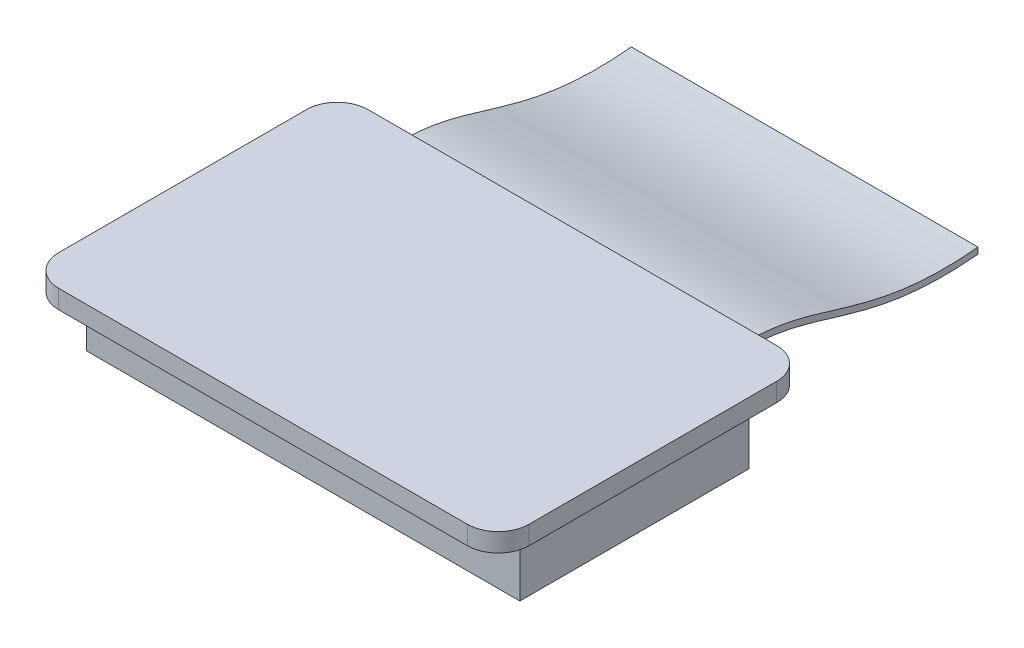
ISO-10303-21;
HEADER;
FILE_DESCRIPTION(('STEP AP214'),'2;1');
FILE_NAME('part.step','',(''),(''),'','','');
FILE_SCHEMA(('AUTOMOTIVE_DESIGN { 1 0 10303 214 1 1 1 1 }'));
ENDSEC;
DATA;
#1=APPLICATION_CONTEXT('core data for automotive mechanical design processes');
#2=APPLICATION_PROTOCOL_DEFINITION('international standard','automotive_design',2000,#1);
#3=PRODUCT_CONTEXT('',#1,'mechanical');
#4=PRODUCT('Part','Part','',(#3));
#5=PRODUCT_RELATED_PRODUCT_CATEGORY('part','',(#4));
#6=PRODUCT_DEFINITION_FORMATION('','',#4);
#7=PRODUCT_DEFINITION_CONTEXT('part definition',#1,'design');
#8=PRODUCT_DEFINITION('design','',#6,#7);
#9=PRODUCT_DEFINITION_SHAPE('','',#8);
#10=(LENGTH_UNIT() NAMED_UNIT(*) SI_UNIT(.MILLI.,.METRE.));
#11=(NAMED_UNIT(*) PLANE_ANGLE_UNIT() SI_UNIT($,.RADIAN.));
#12=(NAMED_UNIT(*) SI_UNIT($,.STERADIAN.) SOLID_ANGLE_UNIT());
#13=UNCERTAINTY_MEASURE_WITH_UNIT(LENGTH_MEASURE(1.E-05),#10,'distance_accuracy_value','');
#14=(GEOMETRIC_REPRESENTATION_CONTEXT(3) GLOBAL_UNCERTAINTY_ASSIGNED_CONTEXT((#13)) GLOBAL_UNIT_ASSIGNED_CONTEXT((#10,
#11,#12)) REPRESENTATION_CONTEXT('',''));
#15=CARTESIAN_POINT('',(0.,0.,0.));
#16=DIRECTION('',(0.,0.,1.));
#17=DIRECTION('',(1.,0.,0.));
#18=AXIS2_PLACEMENT_3D('',#15,#16,#17);
#19=CARTESIAN_POINT('',(3.3,0.748301222298696,8.25169585037883));
#20=DIRECTION('',(0.,-1.,0.));
#21=DIRECTION('',(0.,0.,-1.));
#22=AXIS2_PLACEMENT_3D('',#19,#20,#21);
#23=CYLINDRICAL_SURFACE('',#22,0.5);
#24=CARTESIAN_POINT('',(3.3,0.448301222298696,8.25169585037883));
#25=DIRECTION('',(0.,-1.,0.));
#26=DIRECTION('',(0.,0.,-1.));
#27=AXIS2_PLACEMENT_3D('',#24,#25,#26);
#28=CIRCLE('',#27,0.5);
#29=CARTESIAN_POINT('',(3.3,0.448301222298696,7.75169585037883));
#30=VERTEX_POINT('',#29);
#31=CARTESIAN_POINT('',(3.8,0.448301222298696,8.25169585037883));
#32=VERTEX_POINT('',#31);
#33=EDGE_CURVE('E173',#30,#32,#28,.T.);
#34=ORIENTED_EDGE('',*,*,#33,.F.);
#35=DIRECTION('',(0.,-1.,0.));
#36=VECTOR('',#35,1.);
#37=CARTESIAN_POINT('',(3.3,0.748301222298696,7.75169585037883));
#38=LINE('',#37,#36);
#39=CARTESIAN_POINT('',(3.3,0.748301222298696,7.75169585037883));
#40=VERTEX_POINT('',#39);
#41=EDGE_CURVE('E13',#40,#30,#38,.T.);
#42=ORIENTED_EDGE('',*,*,#41,.F.);
#43=CARTESIAN_POINT('',(3.3,0.748301222298696,8.25169585037883));
#44=DIRECTION('',(0.,-1.,0.));
#45=DIRECTION('',(0.,0.,-1.));
#46=AXIS2_PLACEMENT_3D('',#43,#44,#45);
#47=CIRCLE('',#46,0.5);
#48=CARTESIAN_POINT('',(3.8,0.748301222298696,8.25169585037883));
#49=VERTEX_POINT('',#48);
#50=EDGE_CURVE('E194',#40,#49,#47,.T.);
#51=ORIENTED_EDGE('',*,*,#50,.T.);
#52=DIRECTION('',(0.,-1.,0.));
#53=VECTOR('',#52,1.);
#54=CARTESIAN_POINT('',(3.8,0.748301222298696,8.25169585037883));
#55=LINE('',#54,#53);
#56=EDGE_CURVE('E66',#49,#32,#55,.T.);
#57=ORIENTED_EDGE('',*,*,#56,.T.);
#58=EDGE_LOOP('',(#34,#42,#51,#57));
#59=FACE_BOUND('',#58,.T.);
#60=ADVANCED_FACE('F63',(#59),#23,.T.);
#61=CARTESIAN_POINT('',(-3.3,0.748301222298696,7.75169585037883));
#62=DIRECTION('',(0.,0.,-1.));
#63=DIRECTION('',(-1.,0.,0.));
#64=AXIS2_PLACEMENT_3D('',#61,#62,#63);
#65=PLANE('',#64);
#66=DIRECTION('',(1.,0.,0.));
#67=VECTOR('',#66,1.);
#68=CARTESIAN_POINT('',(-3.3,0.448301222298696,7.75169585037883));
#69=LINE('',#68,#67);
#70=CARTESIAN_POINT('',(-3.3,0.448301222298696,7.75169585037883));
#71=VERTEX_POINT('',#70);
#72=EDGE_CURVE('E192',#71,#30,#69,.T.);
#73=ORIENTED_EDGE('',*,*,#72,.F.);
#74=DIRECTION('',(0.,-1.,0.));
#75=VECTOR('',#74,1.);
#76=CARTESIAN_POINT('',(-3.3,0.748301222298696,7.75169585037883));
#77=LINE('',#76,#75);
#78=CARTESIAN_POINT('',(-3.3,0.748301222298696,7.75169585037883));
#79=VERTEX_POINT('',#78);
#80=EDGE_CURVE('E71',#79,#71,#77,.T.);
#81=ORIENTED_EDGE('',*,*,#80,.F.);
#82=DIRECTION('',(1.,0.,0.));
#83=VECTOR('',#82,1.);
#84=CARTESIAN_POINT('',(-3.3,0.748301222298696,7.75169585037883));
#85=LINE('',#84,#83);
#86=EDGE_CURVE('E163',#79,#40,#85,.T.);
#87=ORIENTED_EDGE('',*,*,#86,.T.);
#88=ORIENTED_EDGE('',*,*,#41,.T.);
#89=EDGE_LOOP('',(#73,#81,#87,#88));
#90=FACE_BOUND('',#89,.T.);
#91=ADVANCED_FACE('F206',(#90),#65,.T.);
#92=CARTESIAN_POINT('',(-3.3,0.748301222298696,8.25169585037883));
#93=DIRECTION('',(0.,-1.,0.));
#94=DIRECTION('',(0.,0.,-1.));
#95=AXIS2_PLACEMENT_3D('',#92,#93,#94);
#96=CYLINDRICAL_SURFACE('',#95,0.5);
#97=CARTESIAN_POINT('',(-3.3,0.448301222298696,8.25169585037883));
#98=DIRECTION('',(0.,-1.,0.));
#99=DIRECTION('',(0.,0.,-1.));
#100=AXIS2_PLACEMENT_3D('',#97,#98,#99);
#101=CIRCLE('',#100,0.5);
#102=CARTESIAN_POINT('',(-3.8,0.448301222298696,8.25169585037883));
#103=VERTEX_POINT('',#102);
#104=EDGE_CURVE('E150',#103,#71,#101,.T.);
#105=ORIENTED_EDGE('',*,*,#104,.F.);
#106=DIRECTION('',(0.,-1.,0.));
#107=VECTOR('',#106,1.);
#108=CARTESIAN_POINT('',(-3.8,0.748301222298696,8.25169585037883));
#109=LINE('',#108,#107);
#110=CARTESIAN_POINT('',(-3.8,0.748301222298696,8.25169585037883));
#111=VERTEX_POINT('',#110);
#112=EDGE_CURVE('E144',#111,#103,#109,.T.);
#113=ORIENTED_EDGE('',*,*,#112,.F.);
#114=CARTESIAN_POINT('',(-3.3,0.748301222298696,8.25169585037883));
#115=DIRECTION('',(0.,-1.,0.));
#116=DIRECTION('',(0.,0.,-1.));
#117=AXIS2_PLACEMENT_3D('',#114,#115,#116);
#118=CIRCLE('',#117,0.5);
#119=EDGE_CURVE('E147',#111,#79,#118,.T.);
#120=ORIENTED_EDGE('',*,*,#119,.T.);
#121=ORIENTED_EDGE('',*,*,#80,.T.);
#122=EDGE_LOOP('',(#105,#113,#120,#121));
#123=FACE_BOUND('',#122,.T.);
#124=ADVANCED_FACE('F146',(#123),#96,.T.);
#125=CARTESIAN_POINT('',(-3.8,0.748301222298696,12.2516958503788));
#126=DIRECTION('',(-1.,0.,0.));
#127=DIRECTION('',(0.,0.,1.));
#128=AXIS2_PLACEMENT_3D('',#125,#126,#127);
#129=PLANE('',#128);
#130=DIRECTION('',(0.,0.,-1.));
#131=VECTOR('',#130,1.);
#132=CARTESIAN_POINT('',(-3.8,0.448301222298696,12.2516958503788));
#133=LINE('',#132,#131);
#134=CARTESIAN_POINT('',(-3.8,0.448301222298696,12.2516958503788));
#135=VERTEX_POINT('',#134);
#136=EDGE_CURVE('E189',#135,#103,#133,.T.);
#137=ORIENTED_EDGE('',*,*,#136,.F.);
#138=DIRECTION('',(0.,-1.,0.));
#139=VECTOR('',#138,1.);
#140=CARTESIAN_POINT('',(-3.8,0.748301222298696,12.2516958503788));
#141=LINE('',#140,#139);
#142=CARTESIAN_POINT('',(-3.8,0.748301222298696,12.2516958503788));
#143=VERTEX_POINT('',#142);
#144=EDGE_CURVE('E155',#143,#135,#141,.T.);
#145=ORIENTED_EDGE('',*,*,#144,.F.);
#146=DIRECTION('',(0.,0.,-1.));
#147=VECTOR('',#146,1.);
#148=CARTESIAN_POINT('',(-3.8,0.748301222298696,12.2516958503788));
#149=LINE('',#148,#147);
#150=EDGE_CURVE('E161',#143,#111,#149,.T.);
#151=ORIENTED_EDGE('',*,*,#150,.T.);
#152=ORIENTED_EDGE('',*,*,#112,.T.);
#153=EDGE_LOOP('',(#137,#145,#151,#152));
#154=FACE_BOUND('',#153,.T.);
#155=ADVANCED_FACE('F165',(#154),#129,.T.);
#156=CARTESIAN_POINT('',(-3.3,0.748301222298696,12.2516958503788));
#157=DIRECTION('',(0.,-1.,0.));
#158=DIRECTION('',(0.,0.,-1.));
#159=AXIS2_PLACEMENT_3D('',#156,#157,#158);
#160=CYLINDRICAL_SURFACE('',#159,0.5);
#161=CARTESIAN_POINT('',(-3.3,0.448301222298696,12.2516958503788));
#162=DIRECTION('',(0.,-1.,0.));
#163=DIRECTION('',(0.,0.,-1.));
#164=AXIS2_PLACEMENT_3D('',#161,#162,#163);
#165=CIRCLE('',#164,0.5);
#166=CARTESIAN_POINT('',(-3.3,0.448301222298696,12.7516958503788));
#167=VERTEX_POINT('',#166);
#168=EDGE_CURVE('E186',#167,#135,#165,.T.);
#169=ORIENTED_EDGE('',*,*,#168,.F.);
#170=DIRECTION('',(0.,-1.,0.));
#171=VECTOR('',#170,1.);
#172=CARTESIAN_POINT('',(-3.3,0.748301222298696,12.7516958503788));
#173=LINE('',#172,#171);
#174=CARTESIAN_POINT('',(-3.3,0.748301222298696,12.7516958503788));
#175=VERTEX_POINT('',#174);
#176=EDGE_CURVE('E198',#175,#167,#173,.T.);
#177=ORIENTED_EDGE('',*,*,#176,.F.);
#178=CARTESIAN_POINT('',(-3.3,0.748301222298696,12.2516958503788));
#179=DIRECTION('',(0.,-1.,0.));
#180=DIRECTION('',(0.,0.,-1.));
#181=AXIS2_PLACEMENT_3D('',#178,#179,#180);
#182=CIRCLE('',#181,0.5);
#183=EDGE_CURVE('E166',#175,#143,#182,.T.);
#184=ORIENTED_EDGE('',*,*,#183,.T.);
#185=ORIENTED_EDGE('',*,*,#144,.T.);
#186=EDGE_LOOP('',(#169,#177,#184,#185));
#187=FACE_BOUND('',#186,.T.);
#188=ADVANCED_FACE('F219',(#187),#160,.T.);
#189=CARTESIAN_POINT('',(-3.3,0.748301222298696,12.7516958503788));
#190=DIRECTION('',(0.,0.,1.));
#191=DIRECTION('',(1.,0.,0.));
#192=AXIS2_PLACEMENT_3D('',#189,#190,#191);
#193=PLANE('',#192);
#194=DIRECTION('',(-1.,0.,0.));
#195=VECTOR('',#194,1.);
#196=CARTESIAN_POINT('',(-3.3,0.448301222298696,12.7516958503788));
#197=LINE('',#196,#195);
#198=CARTESIAN_POINT('',(3.3,0.448301222298696,12.7516958503788));
#199=VERTEX_POINT('',#198);
#200=EDGE_CURVE('E183',#199,#167,#197,.T.);
#201=ORIENTED_EDGE('',*,*,#200,.F.);
#202=DIRECTION('',(0.,-1.,0.));
#203=VECTOR('',#202,1.);
#204=CARTESIAN_POINT('',(3.3,0.748301222298696,12.7516958503788));
#205=LINE('',#204,#203);
#206=CARTESIAN_POINT('',(3.3,0.748301222298696,12.7516958503788));
#207=VERTEX_POINT('',#206);
#208=EDGE_CURVE('E200',#207,#199,#205,.T.);
#209=ORIENTED_EDGE('',*,*,#208,.F.);
#210=DIRECTION('',(-1.,0.,0.));
#211=VECTOR('',#210,1.);
#212=CARTESIAN_POINT('',(-3.3,0.748301222298696,12.7516958503788));
#213=LINE('',#212,#211);
#214=EDGE_CURVE('E168',#207,#175,#213,.T.);
#215=ORIENTED_EDGE('',*,*,#214,.T.);
#216=ORIENTED_EDGE('',*,*,#176,.T.);
#217=EDGE_LOOP('',(#201,#209,#215,#216));
#218=FACE_BOUND('',#217,.T.);
#219=ADVANCED_FACE('F222',(#218),#193,.T.);
#220=CARTESIAN_POINT('',(3.3,0.748301222298696,12.2516958503788));
#221=DIRECTION('',(0.,-1.,0.));
#222=DIRECTION('',(0.,0.,-1.));
#223=AXIS2_PLACEMENT_3D('',#220,#221,#222);
#224=CYLINDRICAL_SURFACE('',#223,0.5);
#225=CARTESIAN_POINT('',(3.3,0.448301222298696,12.2516958503788));
#226=DIRECTION('',(0.,-1.,0.));
#227=DIRECTION('',(0.,0.,1.));
#228=AXIS2_PLACEMENT_3D('',#225,#226,#227);
#229=CIRCLE('',#228,0.5);
#230=CARTESIAN_POINT('',(3.8,0.448301222298696,12.2516958503788));
#231=VERTEX_POINT('',#230);
#232=EDGE_CURVE('E180',#231,#199,#229,.T.);
#233=ORIENTED_EDGE('',*,*,#232,.F.);
#234=DIRECTION('',(0.,-1.,0.));
#235=VECTOR('',#234,1.);
#236=CARTESIAN_POINT('',(3.8,0.748301222298696,12.2516958503788));
#237=LINE('',#236,#235);
#238=CARTESIAN_POINT('',(3.8,0.748301222298696,12.2516958503788));
#239=VERTEX_POINT('',#238);
#240=EDGE_CURVE('E201',#239,#231,#237,.T.);
#241=ORIENTED_EDGE('',*,*,#240,.F.);
#242=CARTESIAN_POINT('',(3.3,0.748301222298696,12.2516958503788));
#243=DIRECTION('',(0.,-1.,0.));
#244=DIRECTION('',(0.,0.,1.));
#245=AXIS2_PLACEMENT_3D('',#242,#243,#244);
#246=CIRCLE('',#245,0.5);
#247=EDGE_CURVE('E290',#239,#207,#246,.T.);
#248=ORIENTED_EDGE('',*,*,#247,.T.);
#249=ORIENTED_EDGE('',*,*,#208,.T.);
#250=EDGE_LOOP('',(#233,#241,#248,#249));
#251=FACE_BOUND('',#250,.T.);
#252=ADVANCED_FACE('F226',(#251),#224,.T.);
#253=CARTESIAN_POINT('',(3.8,0.748301222298696,12.2516958503788));
#254=DIRECTION('',(1.,0.,0.));
#255=DIRECTION('',(0.,0.,-1.));
#256=AXIS2_PLACEMENT_3D('',#253,#254,#255);
#257=PLANE('',#256);
#258=DIRECTION('',(0.,0.,1.));
#259=VECTOR('',#258,1.);
#260=CARTESIAN_POINT('',(3.8,0.448301222298696,12.2516958503788));
#261=LINE('',#260,#259);
#262=EDGE_CURVE('E176',#32,#231,#261,.T.);
#263=ORIENTED_EDGE('',*,*,#262,.F.);
#264=ORIENTED_EDGE('',*,*,#56,.F.);
#265=DIRECTION('',(0.,0.,1.));
#266=VECTOR('',#265,1.);
#267=CARTESIAN_POINT('',(3.8,0.748301222298696,12.2516958503788));
#268=LINE('',#267,#266);
#269=EDGE_CURVE('E288',#49,#239,#268,.T.);
#270=ORIENTED_EDGE('',*,*,#269,.T.);
#271=ORIENTED_EDGE('',*,*,#240,.T.);
#272=EDGE_LOOP('',(#263,#264,#270,#271));
#273=FACE_BOUND('',#272,.T.);
#274=ADVANCED_FACE('F203',(#273),#257,.T.);
#275=CARTESIAN_POINT('',(3.3,0.748301222298696,8.25169585037883));
#276=DIRECTION('',(0.,-1.,0.));
#277=DIRECTION('',(0.,0.,-1.));
#278=AXIS2_PLACEMENT_3D('',#275,#276,#277);
#279=PLANE('',#278);
#280=ORIENTED_EDGE('',*,*,#50,.F.);
#281=ORIENTED_EDGE('',*,*,#86,.F.);
#282=ORIENTED_EDGE('',*,*,#119,.F.);
#283=ORIENTED_EDGE('',*,*,#150,.F.);
#284=ORIENTED_EDGE('',*,*,#183,.F.);
#285=ORIENTED_EDGE('',*,*,#214,.F.);
#286=ORIENTED_EDGE('',*,*,#247,.F.);
#287=ORIENTED_EDGE('',*,*,#269,.F.);
#288=EDGE_LOOP('',(#280,#281,#282,#283,#284,#285,#286,#287));
#289=FACE_BOUND('',#288,.T.);
#290=ADVANCED_FACE('F159',(#289),#279,.F.);
#291=CARTESIAN_POINT('',(3.3,0.448301222298696,8.25169585037883));
#292=DIRECTION('',(0.,-1.,0.));
#293=DIRECTION('',(0.,0.,-1.));
#294=AXIS2_PLACEMENT_3D('',#291,#292,#293);
#295=PLANE('',#294);
#296=DIRECTION('',(0.,0.,1.));
#297=VECTOR('',#296,1.);
#298=CARTESIAN_POINT('',(3.5,0.448301222298696,12.1016958503788));
#299=LINE('',#298,#297);
#300=CARTESIAN_POINT('',(3.5,0.448301222298696,8.40169585037883));
#301=VERTEX_POINT('',#300);
#302=CARTESIAN_POINT('',(3.5,0.448301222298696,12.1016958503788));
#303=VERTEX_POINT('',#302);
#304=EDGE_CURVE('E272',#301,#303,#299,.T.);
#305=ORIENTED_EDGE('',*,*,#304,.F.);
#306=DIRECTION('',(-1.,0.,0.));
#307=VECTOR('',#306,1.);
#308=CARTESIAN_POINT('',(3.5,0.448301222298696,8.40169585037883));
#309=LINE('',#308,#307);
#310=CARTESIAN_POINT('',(-3.5,0.448301222298696,8.40169585037883));
#311=VERTEX_POINT('',#310);
#312=EDGE_CURVE('E283',#301,#311,#309,.T.);
#313=ORIENTED_EDGE('',*,*,#312,.T.);
#314=DIRECTION('',(0.,0.,1.));
#315=VECTOR('',#314,1.);
#316=CARTESIAN_POINT('',(-3.5,0.448301222298696,12.1016958503788));
#317=LINE('',#316,#315);
#318=CARTESIAN_POINT('',(-3.5,0.448301222298696,12.1016958503788));
#319=VERTEX_POINT('',#318);
#320=EDGE_CURVE('E275',#311,#319,#317,.T.);
#321=ORIENTED_EDGE('',*,*,#320,.T.);
#322=DIRECTION('',(-1.,0.,0.));
#323=VECTOR('',#322,1.);
#324=CARTESIAN_POINT('',(3.5,0.448301222298696,12.1016958503788));
#325=LINE('',#324,#323);
#326=EDGE_CURVE('E299',#303,#319,#325,.T.);
#327=ORIENTED_EDGE('',*,*,#326,.F.);
#328=EDGE_LOOP('',(#305,#313,#321,#327));
#329=FACE_BOUND('',#328,.T.);
#330=ORIENTED_EDGE('',*,*,#33,.T.);
#331=ORIENTED_EDGE('',*,*,#262,.T.);
#332=ORIENTED_EDGE('',*,*,#232,.T.);
#333=ORIENTED_EDGE('',*,*,#200,.T.);
#334=ORIENTED_EDGE('',*,*,#168,.T.);
#335=ORIENTED_EDGE('',*,*,#136,.T.);
#336=ORIENTED_EDGE('',*,*,#104,.T.);
#337=ORIENTED_EDGE('',*,*,#72,.T.);
#338=EDGE_LOOP('',(#330,#331,#332,#333,#334,#335,#336,#337));
#339=FACE_BOUND('',#338,.T.);
#340=ADVANCED_FACE('F205',(#329,#339),#295,.T.);
#341=CARTESIAN_POINT('',(3.5,0.448301222298696,12.1016958503788));
#342=DIRECTION('',(0.,0.,-1.));
#343=DIRECTION('',(-1.,0.,0.));
#344=AXIS2_PLACEMENT_3D('',#341,#342,#343);
#345=PLANE('',#344);
#346=DIRECTION('',(0.,-1.,0.));
#347=VECTOR('',#346,1.);
#348=CARTESIAN_POINT('',(-3.5,0.448301222298696,12.1016958503788));
#349=LINE('',#348,#347);
#350=CARTESIAN_POINT('',(-3.5,-0.551698777701304,12.1016958503788));
#351=VERTEX_POINT('',#350);
#352=EDGE_CURVE('E79',#319,#351,#349,.T.);
#353=ORIENTED_EDGE('',*,*,#352,.T.);
#354=DIRECTION('',(-1.,0.,0.));
#355=VECTOR('',#354,1.);
#356=CARTESIAN_POINT('',(3.5,-0.551698777701304,12.1016958503788));
#357=LINE('',#356,#355);
#358=CARTESIAN_POINT('',(3.5,-0.551698777701304,12.1016958503788));
#359=VERTEX_POINT('',#358);
#360=EDGE_CURVE('E177',#359,#351,#357,.T.);
#361=ORIENTED_EDGE('',*,*,#360,.F.);
#362=DIRECTION('',(0.,-1.,0.));
#363=VECTOR('',#362,1.);
#364=CARTESIAN_POINT('',(3.5,0.448301222298696,12.1016958503788));
#365=LINE('',#364,#363);
#366=EDGE_CURVE('E264',#303,#359,#365,.T.);
#367=ORIENTED_EDGE('',*,*,#366,.F.);
#368=ORIENTED_EDGE('',*,*,#326,.T.);
#369=EDGE_LOOP('',(#353,#361,#367,#368));
#370=FACE_BOUND('',#369,.T.);
#371=ADVANCED_FACE('F237',(#370),#345,.F.);
#372=CARTESIAN_POINT('',(3.5,-0.551698777701304,12.1016958503788));
#373=DIRECTION('',(0.,1.,0.));
#374=DIRECTION('',(0.,0.,1.));
#375=AXIS2_PLACEMENT_3D('',#372,#373,#374);
#376=PLANE('',#375);
#377=DIRECTION('',(0.,0.,-1.));
#378=VECTOR('',#377,1.);
#379=CARTESIAN_POINT('',(-3.5,-0.551698777701304,12.1016958503788));
#380=LINE('',#379,#378);
#381=CARTESIAN_POINT('',(-3.5,-0.551698777701304,8.40169585037883));
#382=VERTEX_POINT('',#381);
#383=EDGE_CURVE('E306',#351,#382,#380,.T.);
#384=ORIENTED_EDGE('',*,*,#383,.T.);
#385=DIRECTION('',(-1.,0.,0.));
#386=VECTOR('',#385,1.);
#387=CARTESIAN_POINT('',(3.5,-0.551698777701304,8.40169585037883));
#388=LINE('',#387,#386);
#389=CARTESIAN_POINT('',(3.5,-0.551698777701304,8.40169585037883));
#390=VERTEX_POINT('',#389);
#391=EDGE_CURVE('E280',#390,#382,#388,.T.);
#392=ORIENTED_EDGE('',*,*,#391,.F.);
#393=DIRECTION('',(0.,0.,-1.));
#394=VECTOR('',#393,1.);
#395=CARTESIAN_POINT('',(3.5,-0.551698777701304,12.1016958503788));
#396=LINE('',#395,#394);
#397=EDGE_CURVE('E269',#359,#390,#396,.T.);
#398=ORIENTED_EDGE('',*,*,#397,.F.);
#399=ORIENTED_EDGE('',*,*,#360,.T.);
#400=EDGE_LOOP('',(#384,#392,#398,#399));
#401=FACE_BOUND('',#400,.T.);
#402=ADVANCED_FACE('F242',(#401),#376,.F.);
#403=CARTESIAN_POINT('',(3.5,0.448301222298696,8.40169585037883));
#404=DIRECTION('',(0.,0.,1.));
#405=DIRECTION('',(1.,0.,0.));
#406=AXIS2_PLACEMENT_3D('',#403,#404,#405);
#407=PLANE('',#406);
#408=DIRECTION('',(0.,1.,0.));
#409=VECTOR('',#408,1.);
#410=CARTESIAN_POINT('',(-3.5,0.448301222298696,8.40169585037883));
#411=LINE('',#410,#409);
#412=EDGE_CURVE('E303',#382,#311,#411,.T.);
#413=ORIENTED_EDGE('',*,*,#412,.T.);
#414=ORIENTED_EDGE('',*,*,#312,.F.);
#415=DIRECTION('',(0.,1.,0.));
#416=VECTOR('',#415,1.);
#417=CARTESIAN_POINT('',(3.5,0.448301222298696,8.40169585037883));
#418=LINE('',#417,#416);
#419=EDGE_CURVE('E310',#390,#301,#418,.T.);
#420=ORIENTED_EDGE('',*,*,#419,.F.);
#421=ORIENTED_EDGE('',*,*,#391,.T.);
#422=EDGE_LOOP('',(#413,#414,#420,#421));
#423=FACE_BOUND('',#422,.T.);
#424=ADVANCED_FACE('F246',(#423),#407,.F.);
#425=CARTESIAN_POINT('',(3.5,0.,0.));
#426=DIRECTION('',(1.,0.,0.));
#427=DIRECTION('',(0.,0.,-1.));
#428=AXIS2_PLACEMENT_3D('',#425,#426,#427);
#429=PLANE('',#428);
#430=ORIENTED_EDGE('',*,*,#366,.T.);
#431=ORIENTED_EDGE('',*,*,#397,.T.);
#432=ORIENTED_EDGE('',*,*,#419,.T.);
#433=ORIENTED_EDGE('',*,*,#304,.T.);
#434=EDGE_LOOP('',(#430,#431,#432,#433));
#435=FACE_BOUND('',#434,.T.);
#436=ADVANCED_FACE('F250',(#435),#429,.T.);
#437=CARTESIAN_POINT('',(-3.5,0.,0.));
#438=DIRECTION('',(1.,0.,0.));
#439=DIRECTION('',(0.,0.,-1.));
#440=AXIS2_PLACEMENT_3D('',#437,#438,#439);
#441=PLANE('',#440);
#442=ORIENTED_EDGE('',*,*,#352,.F.);
#443=ORIENTED_EDGE('',*,*,#320,.F.);
#444=ORIENTED_EDGE('',*,*,#412,.F.);
#445=ORIENTED_EDGE('',*,*,#383,.F.);
#446=EDGE_LOOP('',(#442,#443,#444,#445));
#447=FACE_BOUND('',#446,.T.);
#448=ADVANCED_FACE('F252',(#447),#441,.F.);
#449=CLOSED_SHELL('',(#60,#91,#124,#155,#188,#219,#252,#274,#290,#340,#371,#402,#424,#436,#448));
#450=MANIFOLD_SOLID_BREP('B2',#449);
#451=CARTESIAN_POINT('',(0.,0.547843022465262,7.74213394577779));
#452=DIRECTION('',(0.,0.0956190460103406,0.995418001665668));
#453=DIRECTION('',(1.,0.,0.));
#454=AXIS2_PLACEMENT_3D('',#451,#452,#453);
#455=PLANE('',#454);
#456=DIRECTION('',(0.,-0.995418001665668,0.0956190460103406));
#457=VECTOR('',#456,1.);
#458=CARTESIAN_POINT('',(-2.8,0.547843022465262,7.74213394577779));
#459=LINE('',#458,#457);
#460=CARTESIAN_POINT('',(-2.8,0.547843022465262,7.74213394577779));
#461=VERTEX_POINT('',#460);
#462=CARTESIAN_POINT('',(-2.8,0.448301222298696,7.75169585037883));
#463=VERTEX_POINT('',#462);
#464=EDGE_CURVE('E451',#461,#463,#459,.T.);
#465=ORIENTED_EDGE('',*,*,#464,.T.);
#466=DIRECTION('',(1.,0.,0.));
#467=VECTOR('',#466,1.);
#468=CARTESIAN_POINT('',(-2.8,0.448301222298695,7.75169585037883));
#469=LINE('',#468,#467);
#470=CARTESIAN_POINT('',(2.8,0.448301222298696,7.75169585037883));
#471=VERTEX_POINT('',#470);
#472=EDGE_CURVE('E457',#463,#471,#469,.T.);
#473=ORIENTED_EDGE('',*,*,#472,.T.);
#474=DIRECTION('',(0.,0.995418001665668,-0.0956190460103406));
#475=VECTOR('',#474,1.);
#476=CARTESIAN_POINT('',(2.8,0.547843022465263,7.74213394577779));
#477=LINE('',#476,#475);
#478=CARTESIAN_POINT('',(2.8,0.547843022465263,7.74213394577779));
#479=VERTEX_POINT('',#478);
#480=EDGE_CURVE('E452',#471,#479,#477,.T.);
#481=ORIENTED_EDGE('',*,*,#480,.T.);
#482=DIRECTION('',(-1.,0.,0.));
#483=VECTOR('',#482,1.);
#484=CARTESIAN_POINT('',(-2.8,0.547843022465262,7.74213394577779));
#485=LINE('',#484,#483);
#486=EDGE_CURVE('E412',#479,#461,#485,.T.);
#487=ORIENTED_EDGE('',*,*,#486,.T.);
#488=EDGE_LOOP('',(#465,#473,#481,#487));
#489=FACE_BOUND('',#488,.T.);
#490=ADVANCED_FACE('F408',(#489),#455,.T.);
#491=CARTESIAN_POINT('',(0.,0.,3.99999999999998));
#492=DIRECTION('',(0.,0.,1.));
#493=DIRECTION('',(1.,0.,0.));
#494=AXIS2_PLACEMENT_3D('',#491,#492,#493);
#495=PLANE('',#494);
#496=DIRECTION('',(0.,-1.,0.));
#497=VECTOR('',#496,1.);
#498=CARTESIAN_POINT('',(-2.8,0.,3.99999999999998));
#499=LINE('',#498,#497);
#500=CARTESIAN_POINT('',(-2.8,0.,3.99999999999998));
#501=VERTEX_POINT('',#500);
#502=CARTESIAN_POINT('',(-2.8,-0.0999999999999998,3.99999999999998));
#503=VERTEX_POINT('',#502);
#504=EDGE_CURVE('E461',#501,#503,#499,.T.);
#505=ORIENTED_EDGE('',*,*,#504,.F.);
#506=DIRECTION('',(-1.,0.,0.));
#507=VECTOR('',#506,1.);
#508=CARTESIAN_POINT('',(-2.8,0.,3.99999999999998));
#509=LINE('',#508,#507);
#510=CARTESIAN_POINT('',(2.8,0.,3.99999999999998));
#511=VERTEX_POINT('',#510);
#512=EDGE_CURVE('E61',#511,#501,#509,.T.);
#513=ORIENTED_EDGE('',*,*,#512,.F.);
#514=DIRECTION('',(0.,1.,0.));
#515=VECTOR('',#514,1.);
#516=CARTESIAN_POINT('',(2.8,0.,3.99999999999998));
#517=LINE('',#516,#515);
#518=CARTESIAN_POINT('',(2.8,-0.0999999999999998,3.99999999999998));
#519=VERTEX_POINT('',#518);
#520=EDGE_CURVE('E418',#519,#511,#517,.T.);
#521=ORIENTED_EDGE('',*,*,#520,.F.);
#522=DIRECTION('',(1.,0.,0.));
#523=VECTOR('',#522,1.);
#524=CARTESIAN_POINT('',(-2.8,-0.0999999999999998,3.99999999999998));
#525=LINE('',#524,#523);
#526=EDGE_CURVE('E463',#503,#519,#525,.T.);
#527=ORIENTED_EDGE('',*,*,#526,.F.);
#528=EDGE_LOOP('',(#505,#513,#521,#527));
#529=FACE_BOUND('',#528,.T.);
#530=ADVANCED_FACE('F501',(#529),#495,.F.);
#531=CARTESIAN_POINT('',(2.8,0.,3.99999999999998));
#532=CARTESIAN_POINT('',(2.8,-0.024628468128532,4.25638846601688));
#533=CARTESIAN_POINT('',(2.8,-0.0386180157529813,4.72259081002346));
#534=CARTESIAN_POINT('',(2.8,0.0194715301087126,5.31201118533849));
#535=CARTESIAN_POINT('',(2.8,0.129906644668738,5.82138904334296));
#536=CARTESIAN_POINT('',(2.8,0.291873769263778,6.3680270958267));
#537=CARTESIAN_POINT('',(2.8,0.477782991355757,6.96597559310496));
#538=CARTESIAN_POINT('',(2.8,0.547843022465264,7.46326880544397));
#539=CARTESIAN_POINT('',(2.8,0.547843022465264,7.74213394577779));
#540=CARTESIAN_POINT('',(-2.8,0.,3.99999999999998));
#541=CARTESIAN_POINT('',(-2.8,-0.0246284681285331,4.25638846601688));
#542=CARTESIAN_POINT('',(-2.8,-0.0386180157529824,4.72259081002346));
#543=CARTESIAN_POINT('',(-2.8,0.0194715301087115,5.3120111853385));
#544=CARTESIAN_POINT('',(-2.8,0.129906644668737,5.82138904334296));
#545=CARTESIAN_POINT('',(-2.8,0.291873769263777,6.3680270958267));
#546=CARTESIAN_POINT('',(-2.8,0.477782991355756,6.96597559310497));
#547=CARTESIAN_POINT('',(-2.8,0.547843022465263,7.46326880544397));
#548=CARTESIAN_POINT('',(-2.8,0.547843022465263,7.74213394577779));
#549=B_SPLINE_SURFACE_WITH_KNOTS('',1,3,((#531,#532,#533,#534,#535,#536,#537,#538,#539),(#540,
#541,#542,#543,#544,#545,#546,#547,#548)),.UNSPECIFIED.,.F.,.F.,.F.,(2,2),(4,1,1,1,1,1,4),
(0.508771929824561,1.),(0.,0.14,0.28,0.42,0.559999999997895,0.780000000000162,1.),.UNSPECIFIED.);
#550=CARTESIAN_POINT('',(-2.8,0.,3.99999999999998));
#551=CARTESIAN_POINT('',(-2.8,-0.0246284681285331,4.25638846601688));
#552=CARTESIAN_POINT('',(-2.8,-0.0386180157529824,4.72259081002346));
#553=CARTESIAN_POINT('',(-2.8,0.0194715301087115,5.3120111853385));
#554=CARTESIAN_POINT('',(-2.8,0.129906644668737,5.82138904334296));
#555=CARTESIAN_POINT('',(-2.8,0.291873769263777,6.3680270958267));
#556=CARTESIAN_POINT('',(-2.8,0.477782991355756,6.96597559310497));
#557=CARTESIAN_POINT('',(-2.8,0.547843022465263,7.46326880544397));
#558=CARTESIAN_POINT('',(-2.8,0.547843022465263,7.74213394577779));
#559=B_SPLINE_CURVE_WITH_KNOTS('',3,(#550,#551,#552,#553,#554,#555,#556,#557,#558),
.UNSPECIFIED.,.F.,.F.,(4,1,1,1,1,1,4),(0.,0.14,0.28,0.42,0.559999999997895,0.780000000000162,
1.),.UNSPECIFIED.);
#560=EDGE_CURVE('E427',#501,#461,#559,.T.);
#561=CARTESIAN_POINT('',(2.8,0.,3.99999999999998));
#562=CARTESIAN_POINT('',(2.8,-0.024628468128532,4.25638846601688));
#563=CARTESIAN_POINT('',(2.8,-0.0386180157529813,4.72259081002346));
#564=CARTESIAN_POINT('',(2.8,0.0194715301087126,5.31201118533849));
#565=CARTESIAN_POINT('',(2.8,0.129906644668738,5.82138904334296));
#566=CARTESIAN_POINT('',(2.8,0.291873769263778,6.3680270958267));
#567=CARTESIAN_POINT('',(2.8,0.477782991355757,6.96597559310496));
#568=CARTESIAN_POINT('',(2.8,0.547843022465264,7.46326880544397));
#569=CARTESIAN_POINT('',(2.8,0.547843022465264,7.74213394577779));
#570=B_SPLINE_CURVE_WITH_KNOTS('',3,(#561,#562,#563,#564,#565,#566,#567,#568,#569),
.UNSPECIFIED.,.F.,.F.,(4,1,1,1,1,1,4),(0.,0.14,0.28,0.42,0.559999999997895,0.780000000000162,
1.),.UNSPECIFIED.);
#571=EDGE_CURVE('E444',#511,#479,#570,.T.);
#572=ORIENTED_EDGE('',*,*,#512,.T.);
#573=ORIENTED_EDGE('',*,*,#560,.T.);
#574=ORIENTED_EDGE('',*,*,#486,.F.);
#575=ORIENTED_EDGE('',*,*,#571,.F.);
#576=EDGE_LOOP('',(#572,#573,#574,#575));
#577=FACE_BOUND('',#576,.T.);
#578=ADVANCED_FACE('F459',(#577),#549,.T.);
#579=CARTESIAN_POINT('',(2.8,-0.0999999999999998,3.99999999999998));
#580=DIRECTION('',(1.,0.,0.));
#581=DIRECTION('',(0.,1.,0.));
#582=AXIS2_PLACEMENT_3D('',#579,#580,#581);
#583=PLANE('',#582);
#584=ORIENTED_EDGE('',*,*,#520,.T.);
#585=ORIENTED_EDGE('',*,*,#571,.T.);
#586=ORIENTED_EDGE('',*,*,#480,.F.);
#587=CARTESIAN_POINT('',(2.8,-0.0999999999999998,3.99999999999998));
#588=CARTESIAN_POINT('',(2.8,-0.124487822602086,4.2605128606233));
#589=CARTESIAN_POINT('',(2.8,-0.13819607917364,4.73496399384273));
#590=CARTESIAN_POINT('',(2.8,-0.0775684463145836,5.33705516657012));
#591=CARTESIAN_POINT('',(2.8,0.0359942616894102,5.85609097163903));
#592=CARTESIAN_POINT('',(2.8,0.200282397231649,6.4079016266409));
#593=CARTESIAN_POINT('',(2.8,0.38279321622902,6.99976726735009));
#594=CARTESIAN_POINT('',(2.8,0.449818563978634,7.48090729992633));
#595=CARTESIAN_POINT('',(2.8,0.448301222298696,7.75169585037883));
#596=B_SPLINE_CURVE_WITH_KNOTS('',3,(#587,#588,#589,#590,#591,#592,#593,#594,#595),
.UNSPECIFIED.,.F.,.F.,(4,1,1,1,1,1,4),(0.,0.14,0.28,0.42,0.559999999997895,0.780000000000162,
1.),.UNSPECIFIED.);
#597=EDGE_CURVE('E465',#519,#471,#596,.T.);
#598=ORIENTED_EDGE('',*,*,#597,.F.);
#599=EDGE_LOOP('',(#584,#585,#586,#598));
#600=FACE_BOUND('',#599,.T.);
#601=ADVANCED_FACE('F497',(#600),#583,.T.);
#602=CARTESIAN_POINT('',(-2.8,-0.0999999999999998,3.99999999999998));
#603=CARTESIAN_POINT('',(-2.8,-0.124487822602086,4.2605128606233));
#604=CARTESIAN_POINT('',(-2.8,-0.13819607917364,4.73496399384273));
#605=CARTESIAN_POINT('',(-2.8,-0.0775684463145836,5.33705516657012));
#606=CARTESIAN_POINT('',(-2.8,0.0359942616894102,5.85609097163903));
#607=CARTESIAN_POINT('',(-2.8,0.200282397231649,6.4079016266409));
#608=CARTESIAN_POINT('',(-2.8,0.38279321622902,6.99976726735009));
#609=CARTESIAN_POINT('',(-2.8,0.449818563978634,7.48090729992633));
#610=CARTESIAN_POINT('',(-2.8,0.448301222298696,7.75169585037883));
#611=CARTESIAN_POINT('',(2.8,-0.0999999999999998,3.99999999999998));
#612=CARTESIAN_POINT('',(2.8,-0.124487822602086,4.2605128606233));
#613=CARTESIAN_POINT('',(2.8,-0.13819607917364,4.73496399384273));
#614=CARTESIAN_POINT('',(2.8,-0.0775684463145836,5.33705516657012));
#615=CARTESIAN_POINT('',(2.8,0.0359942616894102,5.85609097163903));
#616=CARTESIAN_POINT('',(2.8,0.200282397231649,6.4079016266409));
#617=CARTESIAN_POINT('',(2.8,0.38279321622902,6.99976726735009));
#618=CARTESIAN_POINT('',(2.8,0.449818563978634,7.48090729992633));
#619=CARTESIAN_POINT('',(2.8,0.448301222298696,7.75169585037883));
#620=B_SPLINE_SURFACE_WITH_KNOTS('',1,3,((#602,#603,#604,#605,#606,#607,#608,#609,#610),(#611,
#612,#613,#614,#615,#616,#617,#618,#619)),.UNSPECIFIED.,.F.,.F.,.F.,(2,2),(4,1,1,1,1,1,4),
(0.00877192982456138,0.5),(0.,0.14,0.28,0.42,0.559999999997895,0.780000000000162,1.),.UNSPECIFIED.);
#621=CARTESIAN_POINT('',(-2.8,-0.0999999999999998,3.99999999999998));
#622=CARTESIAN_POINT('',(-2.8,-0.124487822602086,4.2605128606233));
#623=CARTESIAN_POINT('',(-2.8,-0.13819607917364,4.73496399384273));
#624=CARTESIAN_POINT('',(-2.8,-0.0775684463145836,5.33705516657012));
#625=CARTESIAN_POINT('',(-2.8,0.0359942616894102,5.85609097163903));
#626=CARTESIAN_POINT('',(-2.8,0.200282397231649,6.4079016266409));
#627=CARTESIAN_POINT('',(-2.8,0.38279321622902,6.99976726735009));
#628=CARTESIAN_POINT('',(-2.8,0.449818563978634,7.48090729992633));
#629=CARTESIAN_POINT('',(-2.8,0.448301222298696,7.75169585037883));
#630=B_SPLINE_CURVE_WITH_KNOTS('',3,(#621,#622,#623,#624,#625,#626,#627,#628,#629),
.UNSPECIFIED.,.F.,.F.,(4,1,1,1,1,1,4),(0.,0.14,0.28,0.42,0.559999999997895,0.780000000000162,
1.),.UNSPECIFIED.);
#631=EDGE_CURVE('E454',#503,#463,#630,.T.);
#632=ORIENTED_EDGE('',*,*,#526,.T.);
#633=ORIENTED_EDGE('',*,*,#597,.T.);
#634=ORIENTED_EDGE('',*,*,#472,.F.);
#635=ORIENTED_EDGE('',*,*,#631,.F.);
#636=EDGE_LOOP('',(#632,#633,#634,#635));
#637=FACE_BOUND('',#636,.T.);
#638=ADVANCED_FACE('F494',(#637),#620,.T.);
#639=CARTESIAN_POINT('',(-2.8,0.,3.99999999999998));
#640=DIRECTION('',(-1.,0.,0.));
#641=DIRECTION('',(0.,-1.,0.));
#642=AXIS2_PLACEMENT_3D('',#639,#640,#641);
#643=PLANE('',#642);
#644=ORIENTED_EDGE('',*,*,#504,.T.);
#645=ORIENTED_EDGE('',*,*,#631,.T.);
#646=ORIENTED_EDGE('',*,*,#464,.F.);
#647=ORIENTED_EDGE('',*,*,#560,.F.);
#648=EDGE_LOOP('',(#644,#645,#646,#647));
#649=FACE_BOUND('',#648,.T.);
#650=ADVANCED_FACE('F410',(#649),#643,.T.);
#651=CLOSED_SHELL('',(#490,#530,#578,#601,#638,#650));
#652=MANIFOLD_SOLID_BREP('B7',#651);
#653=ADVANCED_BREP_SHAPE_REPRESENTATION('',(#18,#450,#652),#14);
#654=SHAPE_DEFINITION_REPRESENTATION(#9,#653);
ENDSEC;
END-ISO-10303-21;
